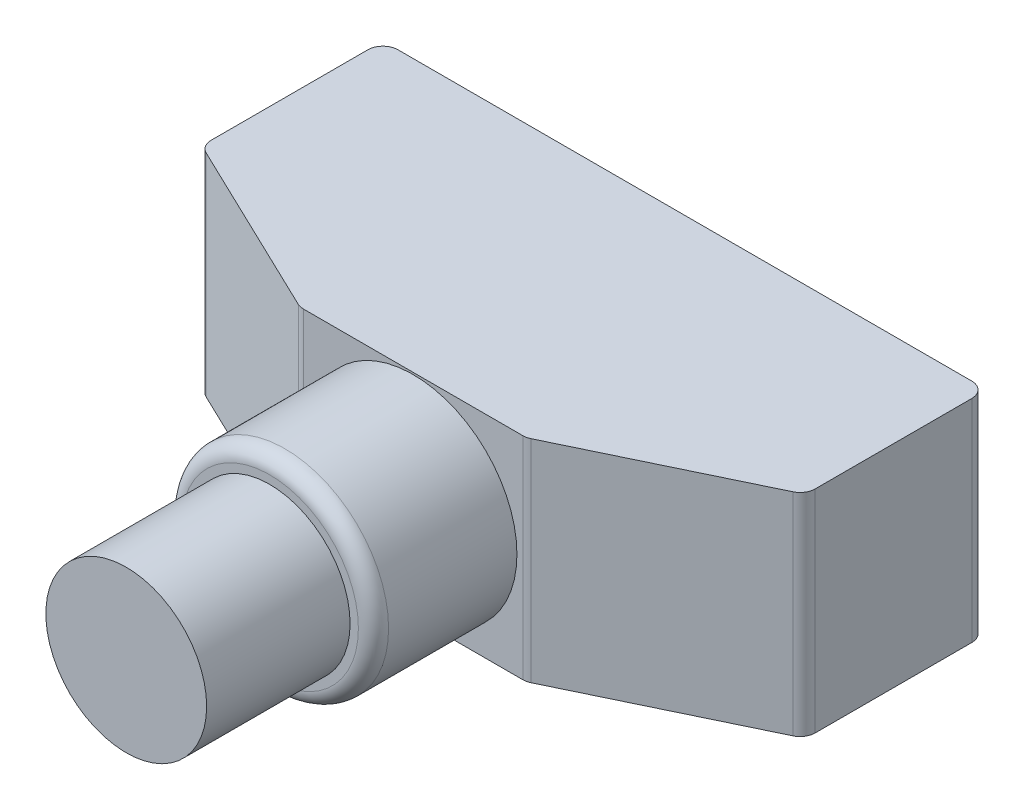
ISO-10303-21;
HEADER;
FILE_DESCRIPTION(('STEP AP214'),'2;1');
FILE_NAME('part.step','',(''),(''),'','','');
FILE_SCHEMA(('AUTOMOTIVE_DESIGN { 1 0 10303 214 1 1 1 1 }'));
ENDSEC;
DATA;
#1=APPLICATION_CONTEXT('core data for automotive mechanical design processes');
#2=APPLICATION_PROTOCOL_DEFINITION('international standard','automotive_design',2000,#1);
#3=PRODUCT_CONTEXT('',#1,'mechanical');
#4=PRODUCT('Part','Part','',(#3));
#5=PRODUCT_RELATED_PRODUCT_CATEGORY('part','',(#4));
#6=PRODUCT_DEFINITION_FORMATION('','',#4);
#7=PRODUCT_DEFINITION_CONTEXT('part definition',#1,'design');
#8=PRODUCT_DEFINITION('design','',#6,#7);
#9=PRODUCT_DEFINITION_SHAPE('','',#8);
#10=(LENGTH_UNIT() NAMED_UNIT(*) SI_UNIT(.MILLI.,.METRE.));
#11=(NAMED_UNIT(*) PLANE_ANGLE_UNIT() SI_UNIT($,.RADIAN.));
#12=(NAMED_UNIT(*) SI_UNIT($,.STERADIAN.) SOLID_ANGLE_UNIT());
#13=UNCERTAINTY_MEASURE_WITH_UNIT(LENGTH_MEASURE(1.E-05),#10,'distance_accuracy_value','');
#14=(GEOMETRIC_REPRESENTATION_CONTEXT(3) GLOBAL_UNCERTAINTY_ASSIGNED_CONTEXT((#13)) GLOBAL_UNIT_ASSIGNED_CONTEXT((#10,
#11,#12)) REPRESENTATION_CONTEXT('',''));
#15=CARTESIAN_POINT('',(0.,0.,0.));
#16=DIRECTION('',(0.,0.,1.));
#17=DIRECTION('',(1.,0.,0.));
#18=AXIS2_PLACEMENT_3D('',#15,#16,#17);
#19=CARTESIAN_POINT('',(0.,14.,0.));
#20=DIRECTION('',(1.,0.,0.));
#21=DIRECTION('',(0.,0.,-1.));
#22=AXIS2_PLACEMENT_3D('',#19,#20,#21);
#23=PLANE('',#22);
#24=DIRECTION('',(0.,0.,1.));
#25=VECTOR('',#24,1.);
#26=CARTESIAN_POINT('',(0.,14.,0.));
#27=LINE('',#26,#25);
#28=CARTESIAN_POINT('',(0.,14.,1.));
#29=VERTEX_POINT('',#28);
#30=CARTESIAN_POINT('',(0.,14.,11.370766030091));
#31=VERTEX_POINT('',#30);
#32=EDGE_CURVE('E148',#29,#31,#27,.T.);
#33=ORIENTED_EDGE('',*,*,#32,.F.);
#34=DIRECTION('',(0.,-1.,0.));
#35=VECTOR('',#34,1.);
#36=CARTESIAN_POINT('',(0.,0.,1.));
#37=LINE('',#36,#35);
#38=CARTESIAN_POINT('',(0.,0.,1.));
#39=VERTEX_POINT('',#38);
#40=EDGE_CURVE('E133',#29,#39,#37,.T.);
#41=ORIENTED_EDGE('',*,*,#40,.T.);
#42=DIRECTION('',(0.,0.,1.));
#43=VECTOR('',#42,1.);
#44=CARTESIAN_POINT('',(0.,0.,0.));
#45=LINE('',#44,#43);
#46=CARTESIAN_POINT('',(0.,0.,11.370766030091));
#47=VERTEX_POINT('',#46);
#48=EDGE_CURVE('E145',#39,#47,#45,.T.);
#49=ORIENTED_EDGE('',*,*,#48,.T.);
#50=DIRECTION('',(0.,-1.,0.));
#51=VECTOR('',#50,1.);
#52=CARTESIAN_POINT('',(0.,14.,11.370766030091));
#53=LINE('',#52,#51);
#54=EDGE_CURVE('E150',#47,#31,#53,.F.);
#55=ORIENTED_EDGE('',*,*,#54,.T.);
#56=EDGE_LOOP('',(#33,#41,#49,#55));
#57=FACE_BOUND('',#56,.T.);
#58=ADVANCED_FACE('F39',(#57),#23,.F.);
#59=CARTESIAN_POINT('',(-4.6814044213264,14.,9.75292587776333));
#60=DIRECTION('',(0.432731067584771,0.,-0.901523057468274));
#61=DIRECTION('',(-0.901523057468274,0.,-0.432731067584771));
#62=AXIS2_PLACEMENT_3D('',#59,#60,#61);
#63=PLANE('',#62);
#64=DIRECTION('',(0.901523057468274,0.,0.432731067584771));
#65=VECTOR('',#64,1.);
#66=CARTESIAN_POINT('',(-4.6814044213264,0.,9.75292587776333));
#67=LINE('',#66,#65);
#68=CARTESIAN_POINT('',(0.56726893241523,0.,12.2722890875593));
#69=VERTEX_POINT('',#68);
#70=CARTESIAN_POINT('',(12.2948397030589,0.,17.9015230574683));
#71=VERTEX_POINT('',#70);
#72=EDGE_CURVE('E154',#69,#71,#67,.T.);
#73=ORIENTED_EDGE('',*,*,#72,.T.);
#74=DIRECTION('',(0.,-1.,0.));
#75=VECTOR('',#74,1.);
#76=CARTESIAN_POINT('',(12.2948397030589,14.,17.9015230574683));
#77=LINE('',#76,#75);
#78=CARTESIAN_POINT('',(12.2948397030589,14.,17.9015230574683));
#79=VERTEX_POINT('',#78);
#80=EDGE_CURVE('E11',#71,#79,#77,.F.);
#81=ORIENTED_EDGE('',*,*,#80,.T.);
#82=DIRECTION('',(0.901523057468274,0.,0.432731067584771));
#83=VECTOR('',#82,1.);
#84=CARTESIAN_POINT('',(-4.6814044213264,14.,9.75292587776333));
#85=LINE('',#84,#83);
#86=CARTESIAN_POINT('',(0.56726893241523,14.,12.2722890875593));
#87=VERTEX_POINT('',#86);
#88=EDGE_CURVE('E226',#87,#79,#85,.T.);
#89=ORIENTED_EDGE('',*,*,#88,.F.);
#90=DIRECTION('',(0.,-1.,0.));
#91=VECTOR('',#90,1.);
#92=CARTESIAN_POINT('',(0.56726893241523,14.,12.2722890875593));
#93=LINE('',#92,#91);
#94=EDGE_CURVE('E47',#87,#69,#93,.T.);
#95=ORIENTED_EDGE('',*,*,#94,.T.);
#96=EDGE_LOOP('',(#73,#81,#89,#95));
#97=FACE_BOUND('',#96,.T.);
#98=ADVANCED_FACE('F223',(#97),#63,.F.);
#99=CARTESIAN_POINT('',(0.,14.,18.));
#100=DIRECTION('',(0.,0.,-1.));
#101=DIRECTION('',(-1.,0.,0.));
#102=AXIS2_PLACEMENT_3D('',#99,#100,#101);
#103=PLANE('',#102);
#104=CARTESIAN_POINT('',(20.,7.,18.));
#105=DIRECTION('',(0.,0.,1.));
#106=DIRECTION('',(1.,0.,0.));
#107=AXIS2_PLACEMENT_3D('',#104,#105,#106);
#108=CIRCLE('',#107,6.875);
#109=CARTESIAN_POINT('',(26.875,7.,18.));
#110=VERTEX_POINT('',#109);
#111=EDGE_CURVE('E250',#110,#110,#108,.T.);
#112=ORIENTED_EDGE('',*,*,#111,.F.);
#113=EDGE_LOOP('',(#112));
#114=FACE_BOUND('',#113,.T.);
#115=DIRECTION('',(1.,0.,0.));
#116=VECTOR('',#115,1.);
#117=CARTESIAN_POINT('',(0.,0.,18.));
#118=LINE('',#117,#116);
#119=CARTESIAN_POINT('',(12.7275707706437,0.,18.));
#120=VERTEX_POINT('',#119);
#121=CARTESIAN_POINT('',(27.2724292293563,0.,18.));
#122=VERTEX_POINT('',#121);
#123=EDGE_CURVE('E158',#120,#122,#118,.T.);
#124=ORIENTED_EDGE('',*,*,#123,.T.);
#125=DIRECTION('',(0.,-1.,0.));
#126=VECTOR('',#125,1.);
#127=CARTESIAN_POINT('',(27.2724292293563,14.,18.));
#128=LINE('',#127,#126);
#129=CARTESIAN_POINT('',(27.2724292293563,14.,18.));
#130=VERTEX_POINT('',#129);
#131=EDGE_CURVE('E218',#122,#130,#128,.F.);
#132=ORIENTED_EDGE('',*,*,#131,.T.);
#133=DIRECTION('',(1.,0.,0.));
#134=VECTOR('',#133,1.);
#135=CARTESIAN_POINT('',(0.,14.,18.));
#136=LINE('',#135,#134);
#137=CARTESIAN_POINT('',(12.7275707706437,14.,18.));
#138=VERTEX_POINT('',#137);
#139=EDGE_CURVE('E239',#138,#130,#136,.T.);
#140=ORIENTED_EDGE('',*,*,#139,.F.);
#141=DIRECTION('',(0.,-1.,0.));
#142=VECTOR('',#141,1.);
#143=CARTESIAN_POINT('',(12.7275707706437,14.,18.));
#144=LINE('',#143,#142);
#145=EDGE_CURVE('E215',#138,#120,#144,.T.);
#146=ORIENTED_EDGE('',*,*,#145,.T.);
#147=EDGE_LOOP('',(#124,#132,#140,#146));
#148=FACE_BOUND('',#147,.T.);
#149=ADVANCED_FACE('F236',(#114,#148),#103,.F.);
#150=CARTESIAN_POINT('',(12.1716514954486,14.,25.3576072821847));
#151=DIRECTION('',(0.432731067584771,0.,0.901523057468274));
#152=DIRECTION('',(0.901523057468274,0.,-0.432731067584771));
#153=AXIS2_PLACEMENT_3D('',#150,#151,#152);
#154=PLANE('',#153);
#155=DIRECTION('',(-0.901523057468274,0.,0.432731067584771));
#156=VECTOR('',#155,1.);
#157=CARTESIAN_POINT('',(12.1716514954486,0.,25.3576072821847));
#158=LINE('',#157,#156);
#159=CARTESIAN_POINT('',(39.4327310675848,0.,12.2722890875593));
#160=VERTEX_POINT('',#159);
#161=CARTESIAN_POINT('',(27.7051602969411,0.,17.9015230574683));
#162=VERTEX_POINT('',#161);
#163=EDGE_CURVE('E168',#160,#162,#158,.T.);
#164=ORIENTED_EDGE('',*,*,#163,.F.);
#165=DIRECTION('',(0.,-1.,0.));
#166=VECTOR('',#165,1.);
#167=CARTESIAN_POINT('',(39.4327310675848,14.,12.2722890875593));
#168=LINE('',#167,#166);
#169=CARTESIAN_POINT('',(39.4327310675848,14.,12.2722890875593));
#170=VERTEX_POINT('',#169);
#171=EDGE_CURVE('E213',#160,#170,#168,.F.);
#172=ORIENTED_EDGE('',*,*,#171,.T.);
#173=DIRECTION('',(-0.901523057468274,0.,0.432731067584771));
#174=VECTOR('',#173,1.);
#175=CARTESIAN_POINT('',(12.1716514954486,14.,25.3576072821847));
#176=LINE('',#175,#174);
#177=CARTESIAN_POINT('',(27.7051602969411,14.,17.9015230574683));
#178=VERTEX_POINT('',#177);
#179=EDGE_CURVE('E241',#170,#178,#176,.T.);
#180=ORIENTED_EDGE('',*,*,#179,.T.);
#181=DIRECTION('',(0.,-1.,0.));
#182=VECTOR('',#181,1.);
#183=CARTESIAN_POINT('',(27.7051602969411,0.,17.9015230574683));
#184=LINE('',#183,#182);
#185=EDGE_CURVE('E210',#178,#162,#184,.T.);
#186=ORIENTED_EDGE('',*,*,#185,.T.);
#187=EDGE_LOOP('',(#164,#172,#180,#186));
#188=FACE_BOUND('',#187,.T.);
#189=ADVANCED_FACE('F297',(#188),#154,.T.);
#190=CARTESIAN_POINT('',(40.,14.,0.));
#191=DIRECTION('',(1.,0.,0.));
#192=DIRECTION('',(0.,0.,-1.));
#193=AXIS2_PLACEMENT_3D('',#190,#191,#192);
#194=PLANE('',#193);
#195=DIRECTION('',(0.,0.,1.));
#196=VECTOR('',#195,1.);
#197=CARTESIAN_POINT('',(40.,0.,0.));
#198=LINE('',#197,#196);
#199=CARTESIAN_POINT('',(40.,0.,1.));
#200=VERTEX_POINT('',#199);
#201=CARTESIAN_POINT('',(40.,0.,11.370766030091));
#202=VERTEX_POINT('',#201);
#203=EDGE_CURVE('E171',#200,#202,#198,.T.);
#204=ORIENTED_EDGE('',*,*,#203,.F.);
#205=DIRECTION('',(0.,-1.,0.));
#206=VECTOR('',#205,1.);
#207=CARTESIAN_POINT('',(40.,14.,1.));
#208=LINE('',#207,#206);
#209=CARTESIAN_POINT('',(40.,14.,1.));
#210=VERTEX_POINT('',#209);
#211=EDGE_CURVE('E61',#200,#210,#208,.F.);
#212=ORIENTED_EDGE('',*,*,#211,.T.);
#213=DIRECTION('',(0.,0.,1.));
#214=VECTOR('',#213,1.);
#215=CARTESIAN_POINT('',(40.,14.,0.));
#216=LINE('',#215,#214);
#217=CARTESIAN_POINT('',(40.,14.,11.370766030091));
#218=VERTEX_POINT('',#217);
#219=EDGE_CURVE('E244',#210,#218,#216,.T.);
#220=ORIENTED_EDGE('',*,*,#219,.T.);
#221=DIRECTION('',(0.,-1.,0.));
#222=VECTOR('',#221,1.);
#223=CARTESIAN_POINT('',(40.,14.,11.370766030091));
#224=LINE('',#223,#222);
#225=EDGE_CURVE('E206',#218,#202,#224,.T.);
#226=ORIENTED_EDGE('',*,*,#225,.T.);
#227=EDGE_LOOP('',(#204,#212,#220,#226));
#228=FACE_BOUND('',#227,.T.);
#229=ADVANCED_FACE('F299',(#228),#194,.T.);
#230=CARTESIAN_POINT('',(0.,14.,0.));
#231=DIRECTION('',(0.,0.,-1.));
#232=DIRECTION('',(-1.,0.,0.));
#233=AXIS2_PLACEMENT_3D('',#230,#231,#232);
#234=PLANE('',#233);
#235=DIRECTION('',(1.,0.,0.));
#236=VECTOR('',#235,1.);
#237=CARTESIAN_POINT('',(0.,0.,0.));
#238=LINE('',#237,#236);
#239=CARTESIAN_POINT('',(1.,0.,0.));
#240=VERTEX_POINT('',#239);
#241=CARTESIAN_POINT('',(39.,0.,0.));
#242=VERTEX_POINT('',#241);
#243=EDGE_CURVE('E174',#240,#242,#238,.T.);
#244=ORIENTED_EDGE('',*,*,#243,.F.);
#245=DIRECTION('',(0.,-1.,0.));
#246=VECTOR('',#245,1.);
#247=CARTESIAN_POINT('',(1.,14.,0.));
#248=LINE('',#247,#246);
#249=CARTESIAN_POINT('',(1.,14.,0.));
#250=VERTEX_POINT('',#249);
#251=EDGE_CURVE('E134',#240,#250,#248,.F.);
#252=ORIENTED_EDGE('',*,*,#251,.T.);
#253=DIRECTION('',(1.,0.,0.));
#254=VECTOR('',#253,1.);
#255=CARTESIAN_POINT('',(0.,14.,0.));
#256=LINE('',#255,#254);
#257=CARTESIAN_POINT('',(39.,14.,0.));
#258=VERTEX_POINT('',#257);
#259=EDGE_CURVE('E163',#250,#258,#256,.T.);
#260=ORIENTED_EDGE('',*,*,#259,.T.);
#261=DIRECTION('',(0.,-1.,0.));
#262=VECTOR('',#261,1.);
#263=CARTESIAN_POINT('',(39.,14.,0.));
#264=LINE('',#263,#262);
#265=EDGE_CURVE('E139',#258,#242,#264,.T.);
#266=ORIENTED_EDGE('',*,*,#265,.T.);
#267=EDGE_LOOP('',(#244,#252,#260,#266));
#268=FACE_BOUND('',#267,.T.);
#269=ADVANCED_FACE('F301',(#268),#234,.T.);
#270=CARTESIAN_POINT('',(0.,14.,0.));
#271=DIRECTION('',(0.,1.,0.));
#272=DIRECTION('',(0.,0.,1.));
#273=AXIS2_PLACEMENT_3D('',#270,#271,#272);
#274=PLANE('',#273);
#275=ORIENTED_EDGE('',*,*,#259,.F.);
#276=CARTESIAN_POINT('',(1.,14.,1.));
#277=DIRECTION('',(0.,1.,0.));
#278=DIRECTION('',(0.,0.,1.));
#279=AXIS2_PLACEMENT_3D('',#276,#277,#278);
#280=CIRCLE('',#279,1.);
#281=EDGE_CURVE('E204',#250,#29,#280,.T.);
#282=ORIENTED_EDGE('',*,*,#281,.T.);
#283=ORIENTED_EDGE('',*,*,#32,.T.);
#284=CARTESIAN_POINT('',(1.,14.,11.370766030091));
#285=DIRECTION('',(0.,1.,0.));
#286=DIRECTION('',(0.,0.,1.));
#287=AXIS2_PLACEMENT_3D('',#284,#285,#286);
#288=CIRCLE('',#287,1.);
#289=EDGE_CURVE('E195',#31,#87,#288,.T.);
#290=ORIENTED_EDGE('',*,*,#289,.T.);
#291=ORIENTED_EDGE('',*,*,#88,.T.);
#292=CARTESIAN_POINT('',(12.7275707706437,14.,17.));
#293=DIRECTION('',(0.,1.,0.));
#294=DIRECTION('',(0.,0.,1.));
#295=AXIS2_PLACEMENT_3D('',#292,#293,#294);
#296=CIRCLE('',#295,1.);
#297=EDGE_CURVE('E197',#79,#138,#296,.T.);
#298=ORIENTED_EDGE('',*,*,#297,.T.);
#299=ORIENTED_EDGE('',*,*,#139,.T.);
#300=CARTESIAN_POINT('',(27.2724292293563,14.,17.));
#301=DIRECTION('',(0.,1.,0.));
#302=DIRECTION('',(0.,0.,1.));
#303=AXIS2_PLACEMENT_3D('',#300,#301,#302);
#304=CIRCLE('',#303,1.);
#305=EDGE_CURVE('E199',#130,#178,#304,.T.);
#306=ORIENTED_EDGE('',*,*,#305,.T.);
#307=ORIENTED_EDGE('',*,*,#179,.F.);
#308=CARTESIAN_POINT('',(39.,14.,11.370766030091));
#309=DIRECTION('',(0.,1.,0.));
#310=DIRECTION('',(0.,0.,1.));
#311=AXIS2_PLACEMENT_3D('',#308,#309,#310);
#312=CIRCLE('',#311,1.);
#313=EDGE_CURVE('E54',#170,#218,#312,.T.);
#314=ORIENTED_EDGE('',*,*,#313,.T.);
#315=ORIENTED_EDGE('',*,*,#219,.F.);
#316=CARTESIAN_POINT('',(39.,14.,1.));
#317=DIRECTION('',(0.,1.,0.));
#318=DIRECTION('',(0.,0.,1.));
#319=AXIS2_PLACEMENT_3D('',#316,#317,#318);
#320=CIRCLE('',#319,1.);
#321=EDGE_CURVE('E202',#210,#258,#320,.T.);
#322=ORIENTED_EDGE('',*,*,#321,.T.);
#323=EDGE_LOOP('',(#275,#282,#283,#290,#291,#298,#299,#306,#307,#314,#315,#322));
#324=FACE_BOUND('',#323,.T.);
#325=ADVANCED_FACE('F260',(#324),#274,.T.);
#326=CARTESIAN_POINT('',(0.,0.,0.));
#327=DIRECTION('',(0.,1.,0.));
#328=DIRECTION('',(0.,0.,1.));
#329=AXIS2_PLACEMENT_3D('',#326,#327,#328);
#330=PLANE('',#329);
#331=ORIENTED_EDGE('',*,*,#48,.F.);
#332=CARTESIAN_POINT('',(1.,0.,1.));
#333=DIRECTION('',(0.,1.,0.));
#334=DIRECTION('',(0.,0.,1.));
#335=AXIS2_PLACEMENT_3D('',#332,#333,#334);
#336=CIRCLE('',#335,1.);
#337=EDGE_CURVE('E129',#39,#240,#336,.F.);
#338=ORIENTED_EDGE('',*,*,#337,.T.);
#339=ORIENTED_EDGE('',*,*,#243,.T.);
#340=CARTESIAN_POINT('',(39.,0.,1.));
#341=DIRECTION('',(0.,1.,0.));
#342=DIRECTION('',(0.,0.,1.));
#343=AXIS2_PLACEMENT_3D('',#340,#341,#342);
#344=CIRCLE('',#343,1.);
#345=EDGE_CURVE('E140',#242,#200,#344,.F.);
#346=ORIENTED_EDGE('',*,*,#345,.T.);
#347=ORIENTED_EDGE('',*,*,#203,.T.);
#348=CARTESIAN_POINT('',(39.,0.,11.370766030091));
#349=DIRECTION('',(0.,1.,0.));
#350=DIRECTION('',(0.,0.,1.));
#351=AXIS2_PLACEMENT_3D('',#348,#349,#350);
#352=CIRCLE('',#351,1.);
#353=EDGE_CURVE('E189',#202,#160,#352,.F.);
#354=ORIENTED_EDGE('',*,*,#353,.T.);
#355=ORIENTED_EDGE('',*,*,#163,.T.);
#356=CARTESIAN_POINT('',(27.2724292293563,0.,17.));
#357=DIRECTION('',(0.,1.,0.));
#358=DIRECTION('',(0.,0.,1.));
#359=AXIS2_PLACEMENT_3D('',#356,#357,#358);
#360=CIRCLE('',#359,1.);
#361=EDGE_CURVE('E187',#162,#122,#360,.F.);
#362=ORIENTED_EDGE('',*,*,#361,.T.);
#363=ORIENTED_EDGE('',*,*,#123,.F.);
#364=CARTESIAN_POINT('',(12.7275707706437,0.,17.));
#365=DIRECTION('',(0.,1.,0.));
#366=DIRECTION('',(0.,0.,1.));
#367=AXIS2_PLACEMENT_3D('',#364,#365,#366);
#368=CIRCLE('',#367,1.);
#369=EDGE_CURVE('E185',#120,#71,#368,.F.);
#370=ORIENTED_EDGE('',*,*,#369,.T.);
#371=ORIENTED_EDGE('',*,*,#72,.F.);
#372=CARTESIAN_POINT('',(1.,0.,11.370766030091));
#373=DIRECTION('',(0.,1.,0.));
#374=DIRECTION('',(0.,0.,1.));
#375=AXIS2_PLACEMENT_3D('',#372,#373,#374);
#376=CIRCLE('',#375,1.);
#377=EDGE_CURVE('E149',#69,#47,#376,.F.);
#378=ORIENTED_EDGE('',*,*,#377,.T.);
#379=EDGE_LOOP('',(#331,#338,#339,#346,#347,#354,#355,#362,#363,#370,#371,#378));
#380=FACE_BOUND('',#379,.T.);
#381=ADVANCED_FACE('F152',(#380),#330,.F.);
#382=CARTESIAN_POINT('',(20.,7.,27.5));
#383=DIRECTION('',(0.,0.,-1.));
#384=DIRECTION('',(-1.,0.,0.));
#385=AXIS2_PLACEMENT_3D('',#382,#383,#384);
#386=CYLINDRICAL_SURFACE('',#385,6.875);
#387=CARTESIAN_POINT('',(20.,7.,26.5));
#388=DIRECTION('',(0.,0.,1.));
#389=DIRECTION('',(1.,0.,0.));
#390=AXIS2_PLACEMENT_3D('',#387,#388,#389);
#391=CIRCLE('',#390,6.875);
#392=CARTESIAN_POINT('',(26.875,7.,26.5));
#393=VERTEX_POINT('',#392);
#394=EDGE_CURVE('E179',#393,#393,#391,.F.);
#395=ORIENTED_EDGE('',*,*,#394,.T.);
#396=EDGE_LOOP('',(#395));
#397=FACE_BOUND('',#396,.T.);
#398=ORIENTED_EDGE('',*,*,#111,.T.);
#399=EDGE_LOOP('',(#398));
#400=FACE_BOUND('',#399,.T.);
#401=ADVANCED_FACE('F351',(#397,#400),#386,.T.);
#402=CARTESIAN_POINT('',(20.,7.,27.5));
#403=DIRECTION('',(0.,0.,1.));
#404=DIRECTION('',(1.,0.,0.));
#405=AXIS2_PLACEMENT_3D('',#402,#403,#404);
#406=PLANE('',#405);
#407=CARTESIAN_POINT('',(20.,7.,27.5));
#408=DIRECTION('',(0.,0.,1.));
#409=DIRECTION('',(1.,0.,0.));
#410=AXIS2_PLACEMENT_3D('',#407,#408,#409);
#411=CIRCLE('',#410,5.875);
#412=CARTESIAN_POINT('',(25.875,7.,27.5));
#413=VERTEX_POINT('',#412);
#414=EDGE_CURVE('E176',#413,#413,#411,.T.);
#415=ORIENTED_EDGE('',*,*,#414,.T.);
#416=EDGE_LOOP('',(#415));
#417=FACE_BOUND('',#416,.T.);
#418=CARTESIAN_POINT('',(20.,7.,27.5));
#419=DIRECTION('',(0.,0.,1.));
#420=DIRECTION('',(1.,0.,0.));
#421=AXIS2_PLACEMENT_3D('',#418,#419,#420);
#422=CIRCLE('',#421,5.325);
#423=CARTESIAN_POINT('',(25.325,7.,27.5));
#424=VERTEX_POINT('',#423);
#425=EDGE_CURVE('E180',#424,#424,#422,.T.);
#426=ORIENTED_EDGE('',*,*,#425,.F.);
#427=EDGE_LOOP('',(#426));
#428=FACE_BOUND('',#427,.T.);
#429=ADVANCED_FACE('F359',(#417,#428),#406,.T.);
#430=CARTESIAN_POINT('',(20.,7.,37.));
#431=DIRECTION('',(0.,0.,-1.));
#432=DIRECTION('',(-1.,0.,0.));
#433=AXIS2_PLACEMENT_3D('',#430,#431,#432);
#434=CYLINDRICAL_SURFACE('',#433,5.325);
#435=CARTESIAN_POINT('',(20.,7.,37.));
#436=DIRECTION('',(0.,0.,1.));
#437=DIRECTION('',(1.,0.,0.));
#438=AXIS2_PLACEMENT_3D('',#435,#436,#437);
#439=CIRCLE('',#438,5.325);
#440=CARTESIAN_POINT('',(25.325,7.,37.));
#441=VERTEX_POINT('',#440);
#442=EDGE_CURVE('E155',#441,#441,#439,.T.);
#443=ORIENTED_EDGE('',*,*,#442,.F.);
#444=EDGE_LOOP('',(#443));
#445=FACE_BOUND('',#444,.T.);
#446=ORIENTED_EDGE('',*,*,#425,.T.);
#447=EDGE_LOOP('',(#446));
#448=FACE_BOUND('',#447,.T.);
#449=ADVANCED_FACE('F369',(#445,#448),#434,.T.);
#450=CARTESIAN_POINT('',(20.,7.,37.));
#451=DIRECTION('',(0.,0.,1.));
#452=DIRECTION('',(1.,0.,0.));
#453=AXIS2_PLACEMENT_3D('',#450,#451,#452);
#454=PLANE('',#453);
#455=ORIENTED_EDGE('',*,*,#442,.T.);
#456=EDGE_LOOP('',(#455));
#457=FACE_BOUND('',#456,.T.);
#458=ADVANCED_FACE('F278',(#457),#454,.T.);
#459=CARTESIAN_POINT('',(20.,7.,26.5));
#460=DIRECTION('',(0.,0.,1.));
#461=DIRECTION('',(1.,0.,0.));
#462=AXIS2_PLACEMENT_3D('',#459,#460,#461);
#463=TOROIDAL_SURFACE('',#462,5.875,1.);
#464=ORIENTED_EDGE('',*,*,#394,.F.);
#465=EDGE_LOOP('',(#464));
#466=FACE_BOUND('',#465,.T.);
#467=ORIENTED_EDGE('',*,*,#414,.F.);
#468=EDGE_LOOP('',(#467));
#469=FACE_BOUND('',#468,.T.);
#470=ADVANCED_FACE('F275',(#466,#469),#463,.T.);
#471=CARTESIAN_POINT('',(1.,14.,1.));
#472=DIRECTION('',(0.,1.,0.));
#473=DIRECTION('',(0.,0.,1.));
#474=AXIS2_PLACEMENT_3D('',#471,#472,#473);
#475=CYLINDRICAL_SURFACE('',#474,1.);
#476=ORIENTED_EDGE('',*,*,#281,.F.);
#477=ORIENTED_EDGE('',*,*,#251,.F.);
#478=ORIENTED_EDGE('',*,*,#337,.F.);
#479=ORIENTED_EDGE('',*,*,#40,.F.);
#480=EDGE_LOOP('',(#476,#477,#478,#479));
#481=FACE_BOUND('',#480,.T.);
#482=ADVANCED_FACE('F132',(#481),#475,.T.);
#483=CARTESIAN_POINT('',(39.,14.,1.));
#484=DIRECTION('',(0.,-1.,0.));
#485=DIRECTION('',(0.,0.,-1.));
#486=AXIS2_PLACEMENT_3D('',#483,#484,#485);
#487=CYLINDRICAL_SURFACE('',#486,1.);
#488=ORIENTED_EDGE('',*,*,#321,.F.);
#489=ORIENTED_EDGE('',*,*,#211,.F.);
#490=ORIENTED_EDGE('',*,*,#345,.F.);
#491=ORIENTED_EDGE('',*,*,#265,.F.);
#492=EDGE_LOOP('',(#488,#489,#490,#491));
#493=FACE_BOUND('',#492,.T.);
#494=ADVANCED_FACE('F282',(#493),#487,.T.);
#495=CARTESIAN_POINT('',(39.,14.,11.370766030091));
#496=DIRECTION('',(0.,-1.,0.));
#497=DIRECTION('',(0.,0.,-1.));
#498=AXIS2_PLACEMENT_3D('',#495,#496,#497);
#499=CYLINDRICAL_SURFACE('',#498,1.);
#500=ORIENTED_EDGE('',*,*,#313,.F.);
#501=ORIENTED_EDGE('',*,*,#171,.F.);
#502=ORIENTED_EDGE('',*,*,#353,.F.);
#503=ORIENTED_EDGE('',*,*,#225,.F.);
#504=EDGE_LOOP('',(#500,#501,#502,#503));
#505=FACE_BOUND('',#504,.T.);
#506=ADVANCED_FACE('F285',(#505),#499,.T.);
#507=CARTESIAN_POINT('',(27.2724292293563,14.,17.));
#508=DIRECTION('',(0.,1.,0.));
#509=DIRECTION('',(0.,0.,1.));
#510=AXIS2_PLACEMENT_3D('',#507,#508,#509);
#511=CYLINDRICAL_SURFACE('',#510,1.);
#512=ORIENTED_EDGE('',*,*,#305,.F.);
#513=ORIENTED_EDGE('',*,*,#131,.F.);
#514=ORIENTED_EDGE('',*,*,#361,.F.);
#515=ORIENTED_EDGE('',*,*,#185,.F.);
#516=EDGE_LOOP('',(#512,#513,#514,#515));
#517=FACE_BOUND('',#516,.T.);
#518=ADVANCED_FACE('F265',(#517),#511,.T.);
#519=CARTESIAN_POINT('',(12.7275707706437,14.,17.));
#520=DIRECTION('',(0.,-1.,0.));
#521=DIRECTION('',(0.,0.,-1.));
#522=AXIS2_PLACEMENT_3D('',#519,#520,#521);
#523=CYLINDRICAL_SURFACE('',#522,1.);
#524=ORIENTED_EDGE('',*,*,#297,.F.);
#525=ORIENTED_EDGE('',*,*,#80,.F.);
#526=ORIENTED_EDGE('',*,*,#369,.F.);
#527=ORIENTED_EDGE('',*,*,#145,.F.);
#528=EDGE_LOOP('',(#524,#525,#526,#527));
#529=FACE_BOUND('',#528,.T.);
#530=ADVANCED_FACE('F233',(#529),#523,.T.);
#531=CARTESIAN_POINT('',(1.,14.,11.370766030091));
#532=DIRECTION('',(0.,-1.,0.));
#533=DIRECTION('',(0.,0.,-1.));
#534=AXIS2_PLACEMENT_3D('',#531,#532,#533);
#535=CYLINDRICAL_SURFACE('',#534,1.);
#536=ORIENTED_EDGE('',*,*,#289,.F.);
#537=ORIENTED_EDGE('',*,*,#54,.F.);
#538=ORIENTED_EDGE('',*,*,#377,.F.);
#539=ORIENTED_EDGE('',*,*,#94,.F.);
#540=EDGE_LOOP('',(#536,#537,#538,#539));
#541=FACE_BOUND('',#540,.T.);
#542=ADVANCED_FACE('F41',(#541),#535,.T.);
#543=CLOSED_SHELL('',(#58,#98,#149,#189,#229,#269,#325,#381,#401,#429,#449,#458,#470,#482,#494,
#506,#518,#530,#542));
#544=MANIFOLD_SOLID_BREP('B2',#543);
#545=ADVANCED_BREP_SHAPE_REPRESENTATION('',(#18,#544),#14);
#546=SHAPE_DEFINITION_REPRESENTATION(#9,#545);
ENDSEC;
END-ISO-10303-21;
